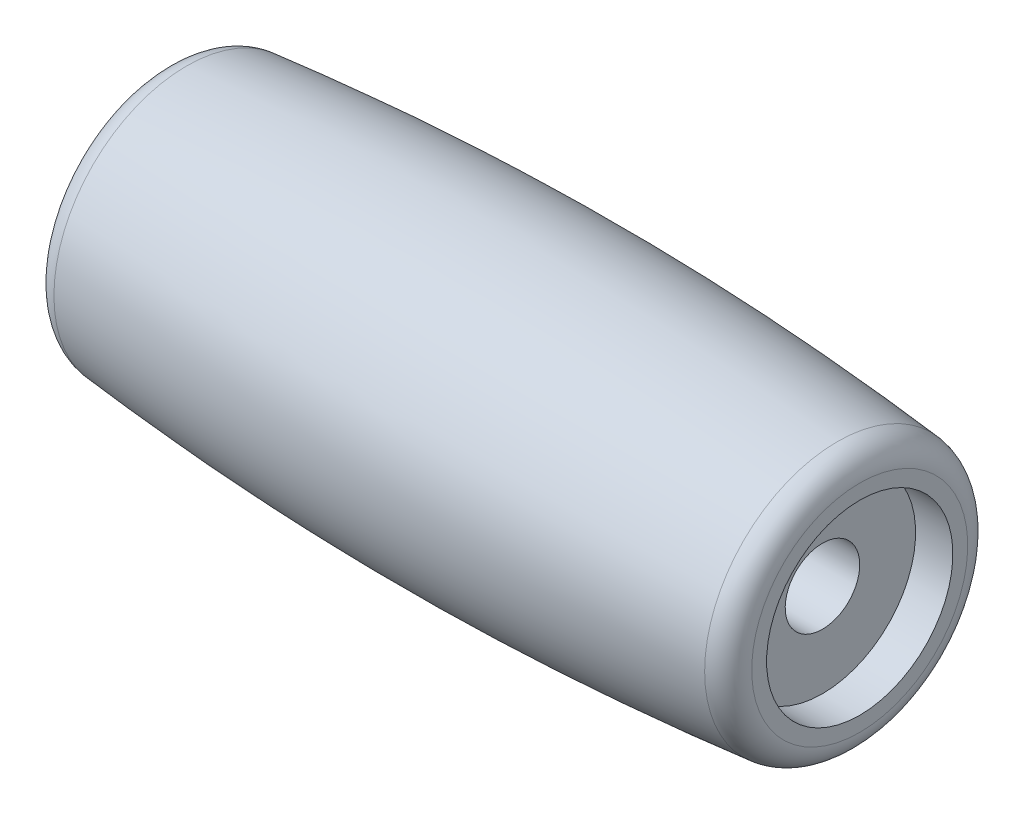
ISO-10303-21;
HEADER;
FILE_DESCRIPTION(('STEP AP214'),'2;1');
FILE_NAME('part.step','',(''),(''),'','','');
FILE_SCHEMA(('AUTOMOTIVE_DESIGN { 1 0 10303 214 1 1 1 1 }'));
ENDSEC;
DATA;
#1=APPLICATION_CONTEXT('core data for automotive mechanical design processes');
#2=APPLICATION_PROTOCOL_DEFINITION('international standard','automotive_design',2000,#1);
#3=PRODUCT_CONTEXT('',#1,'mechanical');
#4=PRODUCT('Part','Part','',(#3));
#5=PRODUCT_RELATED_PRODUCT_CATEGORY('part','',(#4));
#6=PRODUCT_DEFINITION_FORMATION('','',#4);
#7=PRODUCT_DEFINITION_CONTEXT('part definition',#1,'design');
#8=PRODUCT_DEFINITION('design','',#6,#7);
#9=PRODUCT_DEFINITION_SHAPE('','',#8);
#10=(LENGTH_UNIT() NAMED_UNIT(*) SI_UNIT(.MILLI.,.METRE.));
#11=(NAMED_UNIT(*) PLANE_ANGLE_UNIT() SI_UNIT($,.RADIAN.));
#12=(NAMED_UNIT(*) SI_UNIT($,.STERADIAN.) SOLID_ANGLE_UNIT());
#13=UNCERTAINTY_MEASURE_WITH_UNIT(LENGTH_MEASURE(1.E-05),#10,'distance_accuracy_value','');
#14=(GEOMETRIC_REPRESENTATION_CONTEXT(3) GLOBAL_UNCERTAINTY_ASSIGNED_CONTEXT((#13)) GLOBAL_UNIT_ASSIGNED_CONTEXT((#10,
#11,#12)) REPRESENTATION_CONTEXT('',''));
#15=CARTESIAN_POINT('',(0.,0.,0.));
#16=DIRECTION('',(0.,0.,1.));
#17=DIRECTION('',(1.,0.,0.));
#18=AXIS2_PLACEMENT_3D('',#15,#16,#17);
#19=CARTESIAN_POINT('',(-75.,0.,0.));
#20=DIRECTION('',(-1.,0.,0.));
#21=DIRECTION('',(0.,-1.,0.));
#22=AXIS2_PLACEMENT_3D('',#19,#20,#21);
#23=CYLINDRICAL_SURFACE('',#22,3.74999999999998);
#24=CARTESIAN_POINT('',(14.,0.,0.));
#25=DIRECTION('',(-1.,0.,0.));
#26=DIRECTION('',(0.,-1.,0.));
#27=AXIS2_PLACEMENT_3D('',#24,#25,#26);
#28=CIRCLE('',#27,3.74999999999998);
#29=CARTESIAN_POINT('',(14.,-3.74999999999997,0.));
#30=VERTEX_POINT('',#29);
#31=EDGE_CURVE('E10',#30,#30,#28,.T.);
#32=ORIENTED_EDGE('',*,*,#31,.F.);
#33=EDGE_LOOP('',(#32));
#34=FACE_BOUND('',#33,.T.);
#35=CARTESIAN_POINT('',(12.5,0.,0.));
#36=DIRECTION('',(-1.,0.,0.));
#37=DIRECTION('',(0.,-1.,0.));
#38=AXIS2_PLACEMENT_3D('',#35,#36,#37);
#39=CIRCLE('',#38,3.74999999999998);
#40=CARTESIAN_POINT('',(12.5,-3.74999999999997,0.));
#41=VERTEX_POINT('',#40);
#42=EDGE_CURVE('E68',#41,#41,#39,.T.);
#43=ORIENTED_EDGE('',*,*,#42,.T.);
#44=EDGE_LOOP('',(#43));
#45=FACE_BOUND('',#44,.T.);
#46=ADVANCED_FACE('F34',(#34,#45),#23,.F.);
#47=CARTESIAN_POINT('',(14.,3.75,0.));
#48=DIRECTION('',(-1.,0.,0.));
#49=DIRECTION('',(0.,-1.,0.));
#50=AXIS2_PLACEMENT_3D('',#47,#48,#49);
#51=PLANE('',#50);
#52=CARTESIAN_POINT('',(14.,0.,0.));
#53=DIRECTION('',(-1.,0.,0.));
#54=DIRECTION('',(0.,-1.,0.));
#55=AXIS2_PLACEMENT_3D('',#52,#53,#54);
#56=CIRCLE('',#55,4.34837271287945);
#57=CARTESIAN_POINT('',(14.,-4.34837271287943,0.));
#58=VERTEX_POINT('',#57);
#59=EDGE_CURVE('E40',#58,#58,#56,.T.);
#60=ORIENTED_EDGE('',*,*,#59,.F.);
#61=EDGE_LOOP('',(#60));
#62=FACE_BOUND('',#61,.T.);
#63=ORIENTED_EDGE('',*,*,#31,.T.);
#64=EDGE_LOOP('',(#63));
#65=FACE_BOUND('',#64,.T.);
#66=ADVANCED_FACE('F87',(#62,#65),#51,.F.);
#67=CARTESIAN_POINT('',(13.,0.,0.));
#68=DIRECTION('',(-1.,0.,0.));
#69=DIRECTION('',(0.,-1.,0.));
#70=AXIS2_PLACEMENT_3D('',#67,#68,#69);
#71=TOROIDAL_SURFACE('',#70,4.34837271287945,0.999999999999998);
#72=CARTESIAN_POINT('',(13.0997827464215,0.,0.));
#73=DIRECTION('',(-1.,0.,0.));
#74=DIRECTION('',(0.,-1.,0.));
#75=AXIS2_PLACEMENT_3D('',#72,#73,#74);
#76=CIRCLE('',#75,5.34338196083475);
#77=CARTESIAN_POINT('',(13.0997827464215,-5.34338196083474,0.));
#78=VERTEX_POINT('',#77);
#79=EDGE_CURVE('E44',#78,#78,#76,.T.);
#80=ORIENTED_EDGE('',*,*,#79,.F.);
#81=EDGE_LOOP('',(#80));
#82=FACE_BOUND('',#81,.T.);
#83=ORIENTED_EDGE('',*,*,#59,.T.);
#84=EDGE_LOOP('',(#83));
#85=FACE_BOUND('',#84,.T.);
#86=ADVANCED_FACE('F83',(#82,#85),#71,.T.);
#87=CARTESIAN_POINT('',(13.0997827464215,5.34338196083477,0.));
#88=CARTESIAN_POINT('',(8.73325813857914,5.7812711750134,0.));
#89=CARTESIAN_POINT('',(0.000693828203650842,6.21879840432353,0.));
#90=CARTESIAN_POINT('',(-8.73464579498644,5.78113201633955,0.));
#91=CARTESIAN_POINT('',(-13.0997827464215,5.34338196083477,0.));
#92=B_SPLINE_CURVE_WITH_KNOTS('',3,(#87,#88,#89,#90,#91),.UNSPECIFIED.,.F.,.F.,(4,1,4),
(0.0321516724495388,0.499994989031193,0.967838305612847),.UNSPECIFIED.);
#93=CARTESIAN_POINT('',(-75.,0.,0.));
#94=DIRECTION('',(-1.,0.,0.));
#95=AXIS1_PLACEMENT('',#93,#94);
#96=SURFACE_OF_REVOLUTION('',#92,#95);
#97=CARTESIAN_POINT('',(-13.0997827464215,0.,0.));
#98=DIRECTION('',(-1.,0.,0.));
#99=DIRECTION('',(0.,-1.,0.));
#100=AXIS2_PLACEMENT_3D('',#97,#98,#99);
#101=CIRCLE('',#100,5.34338196083476);
#102=CARTESIAN_POINT('',(-13.0997827464215,-5.34338196083475,0.));
#103=VERTEX_POINT('',#102);
#104=EDGE_CURVE('E48',#103,#103,#101,.T.);
#105=ORIENTED_EDGE('',*,*,#104,.F.);
#106=EDGE_LOOP('',(#105));
#107=FACE_BOUND('',#106,.T.);
#108=ORIENTED_EDGE('',*,*,#79,.T.);
#109=EDGE_LOOP('',(#108));
#110=FACE_BOUND('',#109,.T.);
#111=ADVANCED_FACE('F78',(#107,#110),#96,.T.);
#112=CARTESIAN_POINT('',(-13.,0.,0.));
#113=DIRECTION('',(-1.,0.,0.));
#114=DIRECTION('',(0.,-1.,0.));
#115=AXIS2_PLACEMENT_3D('',#112,#113,#114);
#116=TOROIDAL_SURFACE('',#115,4.34837271287945,1.);
#117=CARTESIAN_POINT('',(-14.,0.,0.));
#118=DIRECTION('',(-1.,0.,0.));
#119=DIRECTION('',(0.,-1.,0.));
#120=AXIS2_PLACEMENT_3D('',#117,#118,#119);
#121=CIRCLE('',#120,4.34837271287945);
#122=CARTESIAN_POINT('',(-14.,-4.34837271287944,0.));
#123=VERTEX_POINT('',#122);
#124=EDGE_CURVE('E53',#123,#123,#121,.T.);
#125=ORIENTED_EDGE('',*,*,#124,.F.);
#126=EDGE_LOOP('',(#125));
#127=FACE_BOUND('',#126,.T.);
#128=ORIENTED_EDGE('',*,*,#104,.T.);
#129=EDGE_LOOP('',(#128));
#130=FACE_BOUND('',#129,.T.);
#131=ADVANCED_FACE('F82',(#127,#130),#116,.T.);
#132=CARTESIAN_POINT('',(-14.,3.75,0.));
#133=DIRECTION('',(1.,0.,0.));
#134=DIRECTION('',(0.,1.,0.));
#135=AXIS2_PLACEMENT_3D('',#132,#133,#134);
#136=PLANE('',#135);
#137=CARTESIAN_POINT('',(-14.,0.,0.));
#138=DIRECTION('',(-1.,0.,0.));
#139=DIRECTION('',(0.,-1.,0.));
#140=AXIS2_PLACEMENT_3D('',#137,#138,#139);
#141=CIRCLE('',#140,3.74999999999999);
#142=CARTESIAN_POINT('',(-14.,-3.74999999999998,0.));
#143=VERTEX_POINT('',#142);
#144=EDGE_CURVE('E56',#143,#143,#141,.T.);
#145=ORIENTED_EDGE('',*,*,#144,.F.);
#146=EDGE_LOOP('',(#145));
#147=FACE_BOUND('',#146,.T.);
#148=ORIENTED_EDGE('',*,*,#124,.T.);
#149=EDGE_LOOP('',(#148));
#150=FACE_BOUND('',#149,.T.);
#151=ADVANCED_FACE('F121',(#147,#150),#136,.F.);
#152=CARTESIAN_POINT('',(-75.,0.,0.));
#153=DIRECTION('',(-1.,0.,0.));
#154=DIRECTION('',(0.,-1.,0.));
#155=AXIS2_PLACEMENT_3D('',#152,#153,#154);
#156=CYLINDRICAL_SURFACE('',#155,3.74999999999999);
#157=CARTESIAN_POINT('',(-12.5,0.,0.));
#158=DIRECTION('',(-1.,0.,0.));
#159=DIRECTION('',(0.,-1.,0.));
#160=AXIS2_PLACEMENT_3D('',#157,#158,#159);
#161=CIRCLE('',#160,3.74999999999999);
#162=CARTESIAN_POINT('',(-12.5,-3.74999999999998,0.));
#163=VERTEX_POINT('',#162);
#164=EDGE_CURVE('E59',#163,#163,#161,.T.);
#165=ORIENTED_EDGE('',*,*,#164,.F.);
#166=EDGE_LOOP('',(#165));
#167=FACE_BOUND('',#166,.T.);
#168=ORIENTED_EDGE('',*,*,#144,.T.);
#169=EDGE_LOOP('',(#168));
#170=FACE_BOUND('',#169,.T.);
#171=ADVANCED_FACE('F115',(#167,#170),#156,.F.);
#172=CARTESIAN_POINT('',(-12.5,1.5,0.));
#173=DIRECTION('',(1.,0.,0.));
#174=DIRECTION('',(0.,1.,0.));
#175=AXIS2_PLACEMENT_3D('',#172,#173,#174);
#176=PLANE('',#175);
#177=CARTESIAN_POINT('',(-12.5,0.,0.));
#178=DIRECTION('',(-1.,0.,0.));
#179=DIRECTION('',(0.,-1.,0.));
#180=AXIS2_PLACEMENT_3D('',#177,#178,#179);
#181=CIRCLE('',#180,1.49999999999999);
#182=CARTESIAN_POINT('',(-12.5,-1.49999999999998,0.));
#183=VERTEX_POINT('',#182);
#184=EDGE_CURVE('E62',#183,#183,#181,.T.);
#185=ORIENTED_EDGE('',*,*,#184,.F.);
#186=EDGE_LOOP('',(#185));
#187=FACE_BOUND('',#186,.T.);
#188=ORIENTED_EDGE('',*,*,#164,.T.);
#189=EDGE_LOOP('',(#188));
#190=FACE_BOUND('',#189,.T.);
#191=ADVANCED_FACE('F109',(#187,#190),#176,.F.);
#192=CARTESIAN_POINT('',(-75.,0.,0.));
#193=DIRECTION('',(-1.,0.,0.));
#194=DIRECTION('',(0.,-1.,0.));
#195=AXIS2_PLACEMENT_3D('',#192,#193,#194);
#196=CYLINDRICAL_SURFACE('',#195,1.49999999999999);
#197=CARTESIAN_POINT('',(12.5,0.,0.));
#198=DIRECTION('',(-1.,0.,0.));
#199=DIRECTION('',(0.,-1.,0.));
#200=AXIS2_PLACEMENT_3D('',#197,#198,#199);
#201=CIRCLE('',#200,1.49999999999998);
#202=CARTESIAN_POINT('',(12.5,-1.49999999999997,0.));
#203=VERTEX_POINT('',#202);
#204=EDGE_CURVE('E65',#203,#203,#201,.T.);
#205=ORIENTED_EDGE('',*,*,#204,.F.);
#206=EDGE_LOOP('',(#205));
#207=FACE_BOUND('',#206,.T.);
#208=ORIENTED_EDGE('',*,*,#184,.T.);
#209=EDGE_LOOP('',(#208));
#210=FACE_BOUND('',#209,.T.);
#211=ADVANCED_FACE('F103',(#207,#210),#196,.F.);
#212=CARTESIAN_POINT('',(12.5,1.5,0.));
#213=DIRECTION('',(-1.,0.,0.));
#214=DIRECTION('',(0.,-1.,0.));
#215=AXIS2_PLACEMENT_3D('',#212,#213,#214);
#216=PLANE('',#215);
#217=ORIENTED_EDGE('',*,*,#42,.F.);
#218=EDGE_LOOP('',(#217));
#219=FACE_BOUND('',#218,.T.);
#220=ORIENTED_EDGE('',*,*,#204,.T.);
#221=EDGE_LOOP('',(#220));
#222=FACE_BOUND('',#221,.T.);
#223=ADVANCED_FACE('F100',(#219,#222),#216,.F.);
#224=CLOSED_SHELL('',(#46,#66,#86,#111,#131,#151,#171,#191,#211,#223));
#225=MANIFOLD_SOLID_BREP('B2',#224);
#226=ADVANCED_BREP_SHAPE_REPRESENTATION('',(#18,#225),#14);
#227=SHAPE_DEFINITION_REPRESENTATION(#9,#226);
ENDSEC;
END-ISO-10303-21;
